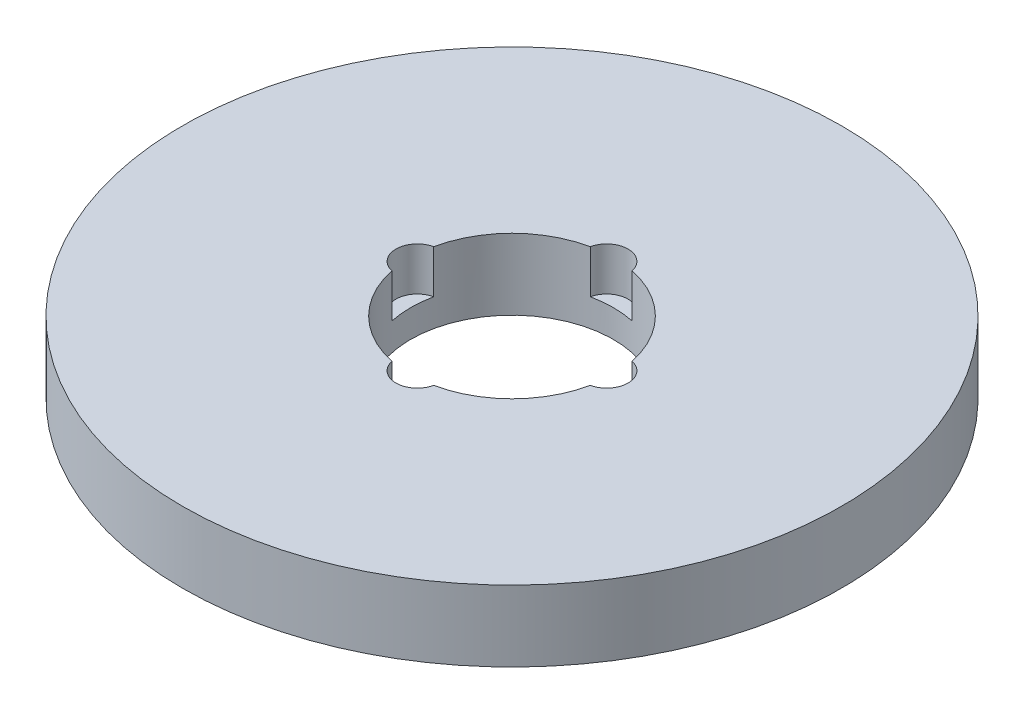
ISO-10303-21;
HEADER;
FILE_DESCRIPTION(('STEP AP214'),'2;1');
FILE_NAME('part.step','',(''),(''),'','','');
FILE_SCHEMA(('AUTOMOTIVE_DESIGN { 1 0 10303 214 1 1 1 1 }'));
ENDSEC;
DATA;
#1=APPLICATION_CONTEXT('core data for automotive mechanical design processes');
#2=APPLICATION_PROTOCOL_DEFINITION('international standard','automotive_design',2000,#1);
#3=PRODUCT_CONTEXT('',#1,'mechanical');
#4=PRODUCT('Part','Part','',(#3));
#5=PRODUCT_RELATED_PRODUCT_CATEGORY('part','',(#4));
#6=PRODUCT_DEFINITION_FORMATION('','',#4);
#7=PRODUCT_DEFINITION_CONTEXT('part definition',#1,'design');
#8=PRODUCT_DEFINITION('design','',#6,#7);
#9=PRODUCT_DEFINITION_SHAPE('','',#8);
#10=(LENGTH_UNIT() NAMED_UNIT(*) SI_UNIT(.MILLI.,.METRE.));
#11=(NAMED_UNIT(*) PLANE_ANGLE_UNIT() SI_UNIT($,.RADIAN.));
#12=(NAMED_UNIT(*) SI_UNIT($,.STERADIAN.) SOLID_ANGLE_UNIT());
#13=UNCERTAINTY_MEASURE_WITH_UNIT(LENGTH_MEASURE(1.E-05),#10,'distance_accuracy_value','');
#14=(GEOMETRIC_REPRESENTATION_CONTEXT(3) GLOBAL_UNCERTAINTY_ASSIGNED_CONTEXT((#13)) GLOBAL_UNIT_ASSIGNED_CONTEXT((#10,
#11,#12)) REPRESENTATION_CONTEXT('',''));
#15=CARTESIAN_POINT('',(0.,0.,0.));
#16=DIRECTION('',(0.,0.,1.));
#17=DIRECTION('',(1.,0.,0.));
#18=AXIS2_PLACEMENT_3D('',#15,#16,#17);
#19=CARTESIAN_POINT('',(0.,7.,0.));
#20=DIRECTION('',(0.,-1.,0.));
#21=DIRECTION('',(0.,0.,-1.));
#22=AXIS2_PLACEMENT_3D('',#19,#20,#21);
#23=CYLINDRICAL_SURFACE('',#22,32.5);
#24=CARTESIAN_POINT('',(0.,7.,0.));
#25=DIRECTION('',(0.,1.,0.));
#26=DIRECTION('',(0.,0.,1.));
#27=AXIS2_PLACEMENT_3D('',#24,#25,#26);
#28=CIRCLE('',#27,32.5);
#29=CARTESIAN_POINT('',(0.,7.,32.5));
#30=VERTEX_POINT('',#29);
#31=EDGE_CURVE('E148',#30,#30,#28,.T.);
#32=ORIENTED_EDGE('',*,*,#31,.F.);
#33=EDGE_LOOP('',(#32));
#34=FACE_BOUND('',#33,.T.);
#35=CARTESIAN_POINT('',(0.,0.,0.));
#36=DIRECTION('',(0.,1.,0.));
#37=DIRECTION('',(0.,0.,1.));
#38=AXIS2_PLACEMENT_3D('',#35,#36,#37);
#39=CIRCLE('',#38,32.5);
#40=CARTESIAN_POINT('',(0.,0.,32.5));
#41=VERTEX_POINT('',#40);
#42=EDGE_CURVE('E139',#41,#41,#39,.T.);
#43=ORIENTED_EDGE('',*,*,#42,.T.);
#44=EDGE_LOOP('',(#43));
#45=FACE_BOUND('',#44,.T.);
#46=ADVANCED_FACE('F39',(#34,#45),#23,.T.);
#47=CARTESIAN_POINT('',(0.,7.,0.));
#48=DIRECTION('',(0.,1.,0.));
#49=DIRECTION('',(0.,0.,1.));
#50=AXIS2_PLACEMENT_3D('',#47,#48,#49);
#51=PLANE('',#50);
#52=CARTESIAN_POINT('',(0.,7.,9.33687664369031));
#53=DIRECTION('',(0.,1.,0.));
#54=DIRECTION('',(1.,0.,0.));
#55=AXIS2_PLACEMENT_3D('',#52,#53,#54);
#56=CIRCLE('',#55,2.10945155154833);
#57=CARTESIAN_POINT('',(-2.0612473617702,7.,9.78525724309767));
#58=VERTEX_POINT('',#57);
#59=CARTESIAN_POINT('',(2.06124736177027,7.,9.78525724309766));
#60=VERTEX_POINT('',#59);
#61=EDGE_CURVE('E175',#58,#60,#56,.T.);
#62=ORIENTED_EDGE('',*,*,#61,.F.);
#63=CARTESIAN_POINT('',(0.,7.,0.));
#64=DIRECTION('',(0.,1.,0.));
#65=DIRECTION('',(0.,0.,1.));
#66=AXIS2_PLACEMENT_3D('',#63,#64,#65);
#67=CIRCLE('',#66,10.);
#68=CARTESIAN_POINT('',(-9.78525724309766,7.,2.06124736177024));
#69=VERTEX_POINT('',#68);
#70=EDGE_CURVE('E134',#69,#58,#67,.T.);
#71=ORIENTED_EDGE('',*,*,#70,.F.);
#72=CARTESIAN_POINT('',(-9.33687664369031,7.,0.));
#73=DIRECTION('',(0.,1.,0.));
#74=DIRECTION('',(0.,0.,1.));
#75=AXIS2_PLACEMENT_3D('',#72,#73,#74);
#76=CIRCLE('',#75,2.10945155154833);
#77=CARTESIAN_POINT('',(-9.78525724309766,7.,-2.06124736177024));
#78=VERTEX_POINT('',#77);
#79=EDGE_CURVE('E143',#78,#69,#76,.T.);
#80=ORIENTED_EDGE('',*,*,#79,.F.);
#81=CARTESIAN_POINT('',(-2.06124736177034,7.,-9.78525724309764));
#82=VERTEX_POINT('',#81);
#83=EDGE_CURVE('E123',#82,#78,#67,.T.);
#84=ORIENTED_EDGE('',*,*,#83,.F.);
#85=CARTESIAN_POINT('',(0.,7.,-9.33687664369031));
#86=DIRECTION('',(0.,1.,0.));
#87=DIRECTION('',(-1.,0.,0.));
#88=AXIS2_PLACEMENT_3D('',#85,#86,#87);
#89=CIRCLE('',#88,2.10945155154833);
#90=CARTESIAN_POINT('',(2.06124736177013,7.,-9.78525724309768));
#91=VERTEX_POINT('',#90);
#92=EDGE_CURVE('E106',#91,#82,#89,.T.);
#93=ORIENTED_EDGE('',*,*,#92,.F.);
#94=CARTESIAN_POINT('',(9.78525724309766,7.,-2.06124736177024));
#95=VERTEX_POINT('',#94);
#96=EDGE_CURVE('E125',#95,#91,#67,.T.);
#97=ORIENTED_EDGE('',*,*,#96,.F.);
#98=CARTESIAN_POINT('',(9.33687664369031,7.,0.));
#99=DIRECTION('',(0.,1.,0.));
#100=DIRECTION('',(0.,0.,-1.));
#101=AXIS2_PLACEMENT_3D('',#98,#99,#100);
#102=CIRCLE('',#101,2.10945155154833);
#103=CARTESIAN_POINT('',(9.78525724309766,7.,2.06124736177024));
#104=VERTEX_POINT('',#103);
#105=EDGE_CURVE('E286',#104,#95,#102,.T.);
#106=ORIENTED_EDGE('',*,*,#105,.F.);
#107=EDGE_CURVE('E135',#60,#104,#67,.T.);
#108=ORIENTED_EDGE('',*,*,#107,.F.);
#109=EDGE_LOOP('',(#62,#71,#80,#84,#93,#97,#106,#108));
#110=FACE_BOUND('',#109,.T.);
#111=ORIENTED_EDGE('',*,*,#31,.T.);
#112=EDGE_LOOP('',(#111));
#113=FACE_BOUND('',#112,.T.);
#114=ADVANCED_FACE('F118',(#110,#113),#51,.T.);
#115=CARTESIAN_POINT('',(0.,0.,0.));
#116=DIRECTION('',(0.,1.,0.));
#117=DIRECTION('',(0.,0.,1.));
#118=AXIS2_PLACEMENT_3D('',#115,#116,#117);
#119=PLANE('',#118);
#120=CARTESIAN_POINT('',(0.,0.,0.));
#121=DIRECTION('',(0.,1.,0.));
#122=DIRECTION('',(0.,0.,1.));
#123=AXIS2_PLACEMENT_3D('',#120,#121,#122);
#124=CIRCLE('',#123,10.);
#125=CARTESIAN_POINT('',(0.,0.,10.));
#126=VERTEX_POINT('',#125);
#127=EDGE_CURVE('E136',#126,#126,#124,.T.);
#128=ORIENTED_EDGE('',*,*,#127,.T.);
#129=EDGE_LOOP('',(#128));
#130=FACE_BOUND('',#129,.T.);
#131=ORIENTED_EDGE('',*,*,#42,.F.);
#132=EDGE_LOOP('',(#131));
#133=FACE_BOUND('',#132,.T.);
#134=ADVANCED_FACE('F187',(#130,#133),#119,.F.);
#135=CARTESIAN_POINT('',(0.,7.,0.));
#136=DIRECTION('',(0.,-1.,0.));
#137=DIRECTION('',(0.,0.,-1.));
#138=AXIS2_PLACEMENT_3D('',#135,#136,#137);
#139=CYLINDRICAL_SURFACE('',#138,10.);
#140=DIRECTION('',(0.,1.,0.));
#141=VECTOR('',#140,1.);
#142=CARTESIAN_POINT('',(-2.0612473617702,4.85913050782174,9.78525724309767));
#143=LINE('',#142,#141);
#144=CARTESIAN_POINT('',(-2.0612473617702,2.71826101564348,9.78525724309767));
#145=VERTEX_POINT('',#144);
#146=EDGE_CURVE('E11',#145,#58,#143,.T.);
#147=ORIENTED_EDGE('',*,*,#146,.F.);
#148=CARTESIAN_POINT('',(0.,2.71826101564348,0.));
#149=DIRECTION('',(0.,1.,0.));
#150=DIRECTION('',(0.,0.,1.));
#151=AXIS2_PLACEMENT_3D('',#148,#149,#150);
#152=CIRCLE('',#151,10.);
#153=CARTESIAN_POINT('',(2.06124736177027,2.71826101564348,9.78525724309766));
#154=VERTEX_POINT('',#153);
#155=EDGE_CURVE('E170',#145,#154,#152,.T.);
#156=ORIENTED_EDGE('',*,*,#155,.T.);
#157=DIRECTION('',(0.,1.,0.));
#158=VECTOR('',#157,1.);
#159=CARTESIAN_POINT('',(2.06124736177027,4.85913050782174,9.78525724309766));
#160=LINE('',#159,#158);
#161=EDGE_CURVE('E46',#60,#154,#160,.F.);
#162=ORIENTED_EDGE('',*,*,#161,.F.);
#163=ORIENTED_EDGE('',*,*,#107,.T.);
#164=DIRECTION('',(0.,1.,0.));
#165=VECTOR('',#164,1.);
#166=CARTESIAN_POINT('',(9.78525724309766,4.85913050782174,2.06124736177024));
#167=LINE('',#166,#165);
#168=CARTESIAN_POINT('',(9.78525724309766,2.71826101564348,2.06124736177024));
#169=VERTEX_POINT('',#168);
#170=EDGE_CURVE('E164',#169,#104,#167,.T.);
#171=ORIENTED_EDGE('',*,*,#170,.F.);
#172=CARTESIAN_POINT('',(0.,2.71826101564348,0.));
#173=DIRECTION('',(0.,1.,0.));
#174=DIRECTION('',(0.,0.,1.));
#175=AXIS2_PLACEMENT_3D('',#172,#173,#174);
#176=CIRCLE('',#175,10.);
#177=CARTESIAN_POINT('',(9.78525724309766,2.71826101564348,-2.06124736177024));
#178=VERTEX_POINT('',#177);
#179=EDGE_CURVE('E115',#169,#178,#176,.T.);
#180=ORIENTED_EDGE('',*,*,#179,.T.);
#181=DIRECTION('',(0.,1.,0.));
#182=VECTOR('',#181,1.);
#183=CARTESIAN_POINT('',(9.78525724309766,4.85913050782174,-2.06124736177024));
#184=LINE('',#183,#182);
#185=EDGE_CURVE('E131',#95,#178,#184,.F.);
#186=ORIENTED_EDGE('',*,*,#185,.F.);
#187=ORIENTED_EDGE('',*,*,#96,.T.);
#188=DIRECTION('',(0.,1.,0.));
#189=VECTOR('',#188,1.);
#190=CARTESIAN_POINT('',(2.06124736177013,4.85913050782174,-9.78525724309768));
#191=LINE('',#190,#189);
#192=CARTESIAN_POINT('',(2.06124736177013,2.71826101564348,-9.78525724309768));
#193=VERTEX_POINT('',#192);
#194=EDGE_CURVE('E105',#193,#91,#191,.T.);
#195=ORIENTED_EDGE('',*,*,#194,.F.);
#196=CARTESIAN_POINT('',(0.,2.71826101564348,0.));
#197=DIRECTION('',(0.,1.,0.));
#198=DIRECTION('',(0.,0.,1.));
#199=AXIS2_PLACEMENT_3D('',#196,#197,#198);
#200=CIRCLE('',#199,10.);
#201=CARTESIAN_POINT('',(-2.06124736177034,2.71826101564348,-9.78525724309764));
#202=VERTEX_POINT('',#201);
#203=EDGE_CURVE('E159',#193,#202,#200,.T.);
#204=ORIENTED_EDGE('',*,*,#203,.T.);
#205=DIRECTION('',(0.,1.,0.));
#206=VECTOR('',#205,1.);
#207=CARTESIAN_POINT('',(-2.06124736177034,4.85913050782174,-9.78525724309764));
#208=LINE('',#207,#206);
#209=EDGE_CURVE('E114',#82,#202,#208,.F.);
#210=ORIENTED_EDGE('',*,*,#209,.F.);
#211=ORIENTED_EDGE('',*,*,#83,.T.);
#212=DIRECTION('',(0.,1.,0.));
#213=VECTOR('',#212,1.);
#214=CARTESIAN_POINT('',(-9.78525724309766,4.85913050782174,-2.06124736177024));
#215=LINE('',#214,#213);
#216=CARTESIAN_POINT('',(-9.78525724309766,2.71826101564348,-2.06124736177024));
#217=VERTEX_POINT('',#216);
#218=EDGE_CURVE('E160',#217,#78,#215,.T.);
#219=ORIENTED_EDGE('',*,*,#218,.F.);
#220=CARTESIAN_POINT('',(0.,2.71826101564348,0.));
#221=DIRECTION('',(0.,1.,0.));
#222=DIRECTION('',(0.,0.,1.));
#223=AXIS2_PLACEMENT_3D('',#220,#221,#222);
#224=CIRCLE('',#223,10.);
#225=CARTESIAN_POINT('',(-9.78525724309766,2.71826101564348,2.06124736177024));
#226=VERTEX_POINT('',#225);
#227=EDGE_CURVE('E149',#217,#226,#224,.T.);
#228=ORIENTED_EDGE('',*,*,#227,.T.);
#229=DIRECTION('',(0.,1.,0.));
#230=VECTOR('',#229,1.);
#231=CARTESIAN_POINT('',(-9.78525724309766,4.85913050782174,2.06124736177024));
#232=LINE('',#231,#230);
#233=EDGE_CURVE('E152',#69,#226,#232,.F.);
#234=ORIENTED_EDGE('',*,*,#233,.F.);
#235=ORIENTED_EDGE('',*,*,#70,.T.);
#236=EDGE_LOOP('',(#147,#156,#162,#163,#171,#180,#186,#187,#195,#204,#210,#211,#219,#228,#234,#235));
#237=FACE_BOUND('',#236,.T.);
#238=ORIENTED_EDGE('',*,*,#127,.F.);
#239=EDGE_LOOP('',(#238));
#240=FACE_BOUND('',#239,.T.);
#241=ADVANCED_FACE('F126',(#237,#240),#139,.F.);
#242=CARTESIAN_POINT('',(-9.33687664369031,2.71826101564348,0.));
#243=DIRECTION('',(0.,1.,0.));
#244=DIRECTION('',(0.,0.,1.));
#245=AXIS2_PLACEMENT_3D('',#242,#243,#244);
#246=CYLINDRICAL_SURFACE('',#245,2.10945155154833);
#247=ORIENTED_EDGE('',*,*,#218,.T.);
#248=ORIENTED_EDGE('',*,*,#79,.T.);
#249=ORIENTED_EDGE('',*,*,#233,.T.);
#250=CARTESIAN_POINT('',(-9.33687664369031,2.71826101564348,0.));
#251=DIRECTION('',(0.,1.,0.));
#252=DIRECTION('',(0.,0.,1.));
#253=AXIS2_PLACEMENT_3D('',#250,#251,#252);
#254=CIRCLE('',#253,2.10945155154833);
#255=EDGE_CURVE('E144',#217,#226,#254,.T.);
#256=ORIENTED_EDGE('',*,*,#255,.F.);
#257=EDGE_LOOP('',(#247,#248,#249,#256));
#258=FACE_BOUND('',#257,.T.);
#259=ADVANCED_FACE('F200',(#258),#246,.F.);
#260=CARTESIAN_POINT('',(-9.33687664369031,2.71826101564348,0.));
#261=DIRECTION('',(0.,1.,0.));
#262=DIRECTION('',(0.,0.,1.));
#263=AXIS2_PLACEMENT_3D('',#260,#261,#262);
#264=PLANE('',#263);
#265=ORIENTED_EDGE('',*,*,#255,.T.);
#266=ORIENTED_EDGE('',*,*,#227,.F.);
#267=EDGE_LOOP('',(#265,#266));
#268=FACE_BOUND('',#267,.T.);
#269=ADVANCED_FACE('F201',(#268),#264,.T.);
#270=CARTESIAN_POINT('',(0.,2.71826101564348,-9.33687664369031));
#271=DIRECTION('',(0.,1.,0.));
#272=DIRECTION('',(0.,0.,1.));
#273=AXIS2_PLACEMENT_3D('',#270,#271,#272);
#274=CYLINDRICAL_SURFACE('',#273,2.10945155154833);
#275=ORIENTED_EDGE('',*,*,#194,.T.);
#276=ORIENTED_EDGE('',*,*,#92,.T.);
#277=ORIENTED_EDGE('',*,*,#209,.T.);
#278=CARTESIAN_POINT('',(0.,2.71826101564348,-9.33687664369031));
#279=DIRECTION('',(0.,1.,0.));
#280=DIRECTION('',(-1.,0.,0.));
#281=AXIS2_PLACEMENT_3D('',#278,#279,#280);
#282=CIRCLE('',#281,2.10945155154833);
#283=EDGE_CURVE('E107',#193,#202,#282,.T.);
#284=ORIENTED_EDGE('',*,*,#283,.F.);
#285=EDGE_LOOP('',(#275,#276,#277,#284));
#286=FACE_BOUND('',#285,.T.);
#287=ADVANCED_FACE('F102',(#286),#274,.F.);
#288=CARTESIAN_POINT('',(0.,2.71826101564348,-9.33687664369031));
#289=DIRECTION('',(0.,1.,0.));
#290=DIRECTION('',(-1.,0.,0.));
#291=AXIS2_PLACEMENT_3D('',#288,#289,#290);
#292=PLANE('',#291);
#293=ORIENTED_EDGE('',*,*,#283,.T.);
#294=ORIENTED_EDGE('',*,*,#203,.F.);
#295=EDGE_LOOP('',(#293,#294));
#296=FACE_BOUND('',#295,.T.);
#297=ADVANCED_FACE('F209',(#296),#292,.T.);
#298=CARTESIAN_POINT('',(9.33687664369031,2.71826101564348,0.));
#299=DIRECTION('',(0.,1.,0.));
#300=DIRECTION('',(0.,0.,1.));
#301=AXIS2_PLACEMENT_3D('',#298,#299,#300);
#302=CYLINDRICAL_SURFACE('',#301,2.10945155154833);
#303=ORIENTED_EDGE('',*,*,#170,.T.);
#304=ORIENTED_EDGE('',*,*,#105,.T.);
#305=ORIENTED_EDGE('',*,*,#185,.T.);
#306=CARTESIAN_POINT('',(9.33687664369031,2.71826101564348,0.));
#307=DIRECTION('',(0.,1.,0.));
#308=DIRECTION('',(0.,0.,-1.));
#309=AXIS2_PLACEMENT_3D('',#306,#307,#308);
#310=CIRCLE('',#309,2.10945155154833);
#311=EDGE_CURVE('E56',#169,#178,#310,.T.);
#312=ORIENTED_EDGE('',*,*,#311,.F.);
#313=EDGE_LOOP('',(#303,#304,#305,#312));
#314=FACE_BOUND('',#313,.T.);
#315=ADVANCED_FACE('F213',(#314),#302,.F.);
#316=CARTESIAN_POINT('',(9.33687664369031,2.71826101564348,0.));
#317=DIRECTION('',(0.,1.,0.));
#318=DIRECTION('',(0.,0.,-1.));
#319=AXIS2_PLACEMENT_3D('',#316,#317,#318);
#320=PLANE('',#319);
#321=ORIENTED_EDGE('',*,*,#311,.T.);
#322=ORIENTED_EDGE('',*,*,#179,.F.);
#323=EDGE_LOOP('',(#321,#322));
#324=FACE_BOUND('',#323,.T.);
#325=ADVANCED_FACE('F179',(#324),#320,.T.);
#326=CARTESIAN_POINT('',(0.,2.71826101564348,9.33687664369031));
#327=DIRECTION('',(0.,1.,0.));
#328=DIRECTION('',(0.,0.,1.));
#329=AXIS2_PLACEMENT_3D('',#326,#327,#328);
#330=CYLINDRICAL_SURFACE('',#329,2.10945155154833);
#331=ORIENTED_EDGE('',*,*,#146,.T.);
#332=ORIENTED_EDGE('',*,*,#61,.T.);
#333=ORIENTED_EDGE('',*,*,#161,.T.);
#334=CARTESIAN_POINT('',(0.,2.71826101564348,9.33687664369031));
#335=DIRECTION('',(0.,1.,0.));
#336=DIRECTION('',(1.,0.,0.));
#337=AXIS2_PLACEMENT_3D('',#334,#335,#336);
#338=CIRCLE('',#337,2.10945155154833);
#339=EDGE_CURVE('E55',#145,#154,#338,.T.);
#340=ORIENTED_EDGE('',*,*,#339,.F.);
#341=EDGE_LOOP('',(#331,#332,#333,#340));
#342=FACE_BOUND('',#341,.T.);
#343=ADVANCED_FACE('F171',(#342),#330,.F.);
#344=CARTESIAN_POINT('',(0.,2.71826101564348,9.33687664369031));
#345=DIRECTION('',(0.,1.,0.));
#346=DIRECTION('',(1.,0.,0.));
#347=AXIS2_PLACEMENT_3D('',#344,#345,#346);
#348=PLANE('',#347);
#349=ORIENTED_EDGE('',*,*,#339,.T.);
#350=ORIENTED_EDGE('',*,*,#155,.F.);
#351=EDGE_LOOP('',(#349,#350));
#352=FACE_BOUND('',#351,.T.);
#353=ADVANCED_FACE('F173',(#352),#348,.T.);
#354=CLOSED_SHELL('',(#46,#114,#134,#241,#259,#269,#287,#297,#315,#325,#343,#353));
#355=MANIFOLD_SOLID_BREP('B2',#354);
#356=ADVANCED_BREP_SHAPE_REPRESENTATION('',(#18,#355),#14);
#357=SHAPE_DEFINITION_REPRESENTATION(#9,#356);
ENDSEC;
END-ISO-10303-21;
